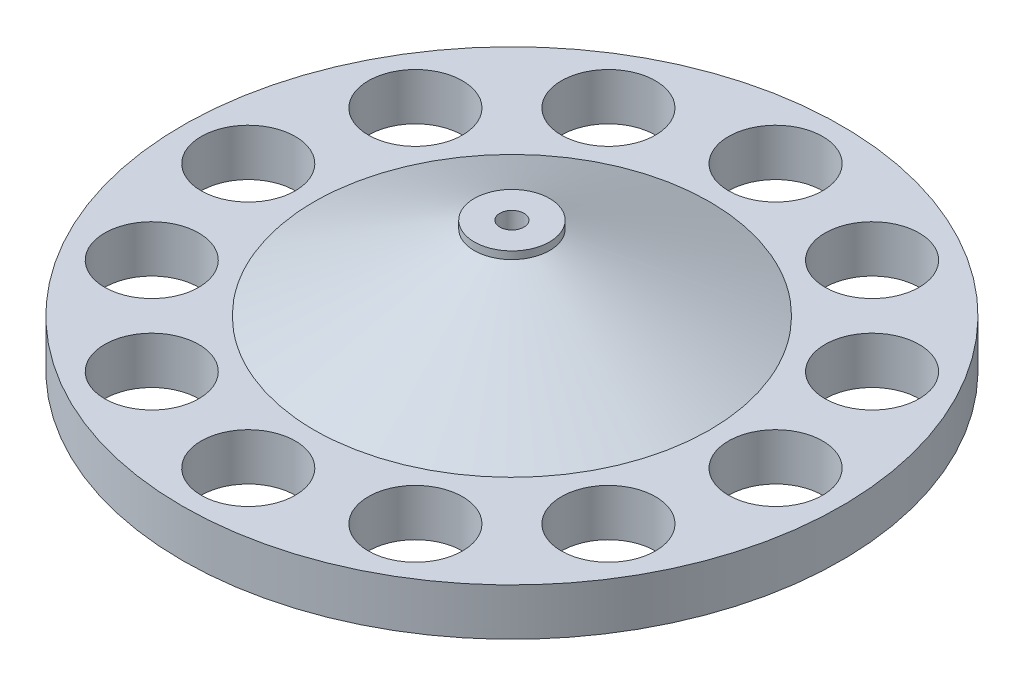
ISO-10303-21;
HEADER;
FILE_DESCRIPTION(('STEP AP214'),'2;1');
FILE_NAME('part.step','',(''),(''),'','','');
FILE_SCHEMA(('AUTOMOTIVE_DESIGN { 1 0 10303 214 1 1 1 1 }'));
ENDSEC;
DATA;
#1=APPLICATION_CONTEXT('core data for automotive mechanical design processes');
#2=APPLICATION_PROTOCOL_DEFINITION('international standard','automotive_design',2000,#1);
#3=PRODUCT_CONTEXT('',#1,'mechanical');
#4=PRODUCT('Part','Part','',(#3));
#5=PRODUCT_RELATED_PRODUCT_CATEGORY('part','',(#4));
#6=PRODUCT_DEFINITION_FORMATION('','',#4);
#7=PRODUCT_DEFINITION_CONTEXT('part definition',#1,'design');
#8=PRODUCT_DEFINITION('design','',#6,#7);
#9=PRODUCT_DEFINITION_SHAPE('','',#8);
#10=(LENGTH_UNIT() NAMED_UNIT(*) SI_UNIT(.MILLI.,.METRE.));
#11=(NAMED_UNIT(*) PLANE_ANGLE_UNIT() SI_UNIT($,.RADIAN.));
#12=(NAMED_UNIT(*) SI_UNIT($,.STERADIAN.) SOLID_ANGLE_UNIT());
#13=UNCERTAINTY_MEASURE_WITH_UNIT(LENGTH_MEASURE(1.E-05),#10,'distance_accuracy_value','');
#14=(GEOMETRIC_REPRESENTATION_CONTEXT(3) GLOBAL_UNCERTAINTY_ASSIGNED_CONTEXT((#13)) GLOBAL_UNIT_ASSIGNED_CONTEXT((#10,
#11,#12)) REPRESENTATION_CONTEXT('',''));
#15=CARTESIAN_POINT('',(0.,0.,0.));
#16=DIRECTION('',(0.,0.,1.));
#17=DIRECTION('',(1.,0.,0.));
#18=AXIS2_PLACEMENT_3D('',#15,#16,#17);
#19=CARTESIAN_POINT('',(0.,25.,0.));
#20=DIRECTION('',(0.,1.,0.));
#21=DIRECTION('',(0.,0.,1.));
#22=AXIS2_PLACEMENT_3D('',#19,#20,#21);
#23=PLANE('',#22);
#24=CARTESIAN_POINT('',(-69.999999999996,25.,-121.243556529806));
#25=DIRECTION('',(0.,1.,0.));
#26=DIRECTION('',(0.,0.,1.));
#27=AXIS2_PLACEMENT_3D('',#24,#25,#26);
#28=CIRCLE('',#27,25.0000000000116);
#29=CARTESIAN_POINT('',(-69.999999999996,25.,-96.2435565297948));
#30=VERTEX_POINT('',#29);
#31=EDGE_CURVE('E126',#30,#30,#28,.T.);
#32=ORIENTED_EDGE('',*,*,#31,.F.);
#33=EDGE_LOOP('',(#32));
#34=FACE_BOUND('',#33,.T.);
#35=CARTESIAN_POINT('',(-139.99999999997,25.,2.98342223743302E-11));
#36=DIRECTION('',(0.,1.,0.));
#37=DIRECTION('',(0.,0.,1.));
#38=AXIS2_PLACEMENT_3D('',#35,#36,#37);
#39=CIRCLE('',#38,25.0000000000399);
#40=CARTESIAN_POINT('',(-139.99999999997,25.,25.0000000000698));
#41=VERTEX_POINT('',#40);
#42=EDGE_CURVE('E138',#41,#41,#39,.T.);
#43=ORIENTED_EDGE('',*,*,#42,.F.);
#44=EDGE_LOOP('',(#43));
#45=FACE_BOUND('',#44,.T.);
#46=CARTESIAN_POINT('',(-69.9999999999443,25.,121.243556529836));
#47=DIRECTION('',(0.,1.,0.));
#48=DIRECTION('',(0.,0.,1.));
#49=AXIS2_PLACEMENT_3D('',#46,#47,#48);
#50=CIRCLE('',#49,25.0000000000597);
#51=CARTESIAN_POINT('',(-69.9999999999443,25.,146.243556529896));
#52=VERTEX_POINT('',#51);
#53=EDGE_CURVE('E150',#52,#52,#50,.T.);
#54=ORIENTED_EDGE('',*,*,#53,.F.);
#55=EDGE_LOOP('',(#54));
#56=FACE_BOUND('',#55,.T.);
#57=CARTESIAN_POINT('',(70.0000000000556,25.,121.243556529806));
#58=DIRECTION('',(0.,1.,0.));
#59=DIRECTION('',(0.,0.,1.));
#60=AXIS2_PLACEMENT_3D('',#57,#58,#59);
#61=CIRCLE('',#60,25.0000000000523);
#62=CARTESIAN_POINT('',(70.0000000000556,25.,146.243556529859));
#63=VERTEX_POINT('',#62);
#64=EDGE_CURVE('E162',#63,#63,#61,.T.);
#65=ORIENTED_EDGE('',*,*,#64,.F.);
#66=EDGE_LOOP('',(#65));
#67=FACE_BOUND('',#66,.T.);
#68=CARTESIAN_POINT('',(140.00000000003,25.,-2.98170773191421E-11));
#69=DIRECTION('',(0.,1.,0.));
#70=DIRECTION('',(0.,0.,1.));
#71=AXIS2_PLACEMENT_3D('',#68,#69,#70);
#72=CIRCLE('',#71,25.0000000000226);
#73=CARTESIAN_POINT('',(140.00000000003,25.,24.9999999999928));
#74=VERTEX_POINT('',#73);
#75=EDGE_CURVE('E174',#74,#74,#72,.T.);
#76=ORIENTED_EDGE('',*,*,#75,.F.);
#77=EDGE_LOOP('',(#76));
#78=FACE_BOUND('',#77,.T.);
#79=CARTESIAN_POINT('',(70.0000000000058,25.,-121.243556529834));
#80=DIRECTION('',(0.,1.,0.));
#81=DIRECTION('',(0.,0.,1.));
#82=AXIS2_PLACEMENT_3D('',#79,#80,#81);
#83=CIRCLE('',#82,24.9999999999994);
#84=CARTESIAN_POINT('',(70.0000000000058,25.,-96.2435565298347));
#85=VERTEX_POINT('',#84);
#86=EDGE_CURVE('E186',#85,#85,#83,.T.);
#87=ORIENTED_EDGE('',*,*,#86,.F.);
#88=EDGE_LOOP('',(#87));
#89=FACE_BOUND('',#88,.T.);
#90=CARTESIAN_POINT('',(0.,25.,0.));
#91=DIRECTION('',(0.,1.,0.));
#92=DIRECTION('',(0.,0.,1.));
#93=AXIS2_PLACEMENT_3D('',#90,#91,#92);
#94=CIRCLE('',#93,175.);
#95=CARTESIAN_POINT('',(0.,25.,175.));
#96=VERTEX_POINT('',#95);
#97=EDGE_CURVE('E56',#96,#96,#94,.T.);
#98=ORIENTED_EDGE('',*,*,#97,.T.);
#99=EDGE_LOOP('',(#98));
#100=FACE_BOUND('',#99,.T.);
#101=CARTESIAN_POINT('',(0.,25.,-140.));
#102=DIRECTION('',(0.,1.,0.));
#103=DIRECTION('',(0.,0.,1.));
#104=AXIS2_PLACEMENT_3D('',#101,#102,#103);
#105=CIRCLE('',#104,25.);
#106=CARTESIAN_POINT('',(0.,25.,-115.));
#107=VERTEX_POINT('',#106);
#108=EDGE_CURVE('E192',#107,#107,#105,.T.);
#109=ORIENTED_EDGE('',*,*,#108,.F.);
#110=EDGE_LOOP('',(#109));
#111=FACE_BOUND('',#110,.T.);
#112=CARTESIAN_POINT('',(121.243556529836,25.,-70.0000000000258));
#113=DIRECTION('',(0.,1.,0.));
#114=DIRECTION('',(0.,0.,1.));
#115=AXIS2_PLACEMENT_3D('',#112,#113,#114);
#116=CIRCLE('',#115,25.0000000000092);
#117=CARTESIAN_POINT('',(121.243556529836,25.,-45.0000000000166));
#118=VERTEX_POINT('',#117);
#119=EDGE_CURVE('E180',#118,#118,#116,.T.);
#120=ORIENTED_EDGE('',*,*,#119,.F.);
#121=EDGE_LOOP('',(#120));
#122=FACE_BOUND('',#121,.T.);
#123=CARTESIAN_POINT('',(121.243556529866,25.,69.9999999999742));
#124=DIRECTION('',(0.,1.,0.));
#125=DIRECTION('',(0.,0.,1.));
#126=AXIS2_PLACEMENT_3D('',#123,#124,#125);
#127=CIRCLE('',#126,25.0000000000383);
#128=CARTESIAN_POINT('',(121.243556529866,25.,95.0000000000124));
#129=VERTEX_POINT('',#128);
#130=EDGE_CURVE('E168',#129,#129,#127,.T.);
#131=ORIENTED_EDGE('',*,*,#130,.F.);
#132=EDGE_LOOP('',(#131));
#133=FACE_BOUND('',#132,.T.);
#134=CARTESIAN_POINT('',(5.96353792850834E-11,25.,140.));
#135=DIRECTION('',(0.,1.,0.));
#136=DIRECTION('',(0.,0.,1.));
#137=AXIS2_PLACEMENT_3D('',#134,#135,#136);
#138=CIRCLE('',#137,25.0000000000607);
#139=CARTESIAN_POINT('',(5.96353792850834E-11,25.,165.000000000061));
#140=VERTEX_POINT('',#139);
#141=EDGE_CURVE('E156',#140,#140,#138,.T.);
#142=ORIENTED_EDGE('',*,*,#141,.F.);
#143=EDGE_LOOP('',(#142));
#144=FACE_BOUND('',#143,.T.);
#145=CARTESIAN_POINT('',(-121.243556529777,25.,70.0000000000259));
#146=DIRECTION('',(0.,1.,0.));
#147=DIRECTION('',(0.,0.,1.));
#148=AXIS2_PLACEMENT_3D('',#145,#146,#147);
#149=CIRCLE('',#148,25.0000000000527);
#150=CARTESIAN_POINT('',(-121.243556529777,25.,95.0000000000786));
#151=VERTEX_POINT('',#150);
#152=EDGE_CURVE('E144',#151,#151,#149,.T.);
#153=ORIENTED_EDGE('',*,*,#152,.F.);
#154=EDGE_LOOP('',(#153));
#155=FACE_BOUND('',#154,.T.);
#156=CARTESIAN_POINT('',(-121.243556529807,25.,-69.9999999999741));
#157=DIRECTION('',(0.,1.,0.));
#158=DIRECTION('',(0.,0.,1.));
#159=AXIS2_PLACEMENT_3D('',#156,#157,#158);
#160=CIRCLE('',#159,25.000000000025);
#161=CARTESIAN_POINT('',(-121.243556529807,25.,-44.999999999949));
#162=VERTEX_POINT('',#161);
#163=EDGE_CURVE('E132',#162,#162,#160,.T.);
#164=ORIENTED_EDGE('',*,*,#163,.F.);
#165=EDGE_LOOP('',(#164));
#166=FACE_BOUND('',#165,.T.);
#167=CARTESIAN_POINT('',(0.,25.,0.));
#168=DIRECTION('',(0.,1.,0.));
#169=DIRECTION('',(0.,0.,1.));
#170=AXIS2_PLACEMENT_3D('',#167,#168,#169);
#171=CIRCLE('',#170,105.);
#172=CARTESIAN_POINT('',(74.5720447437482,25.,-73.9189430574897));
#173=VERTEX_POINT('',#172);
#174=EDGE_CURVE('E112',#173,#173,#171,.T.);
#175=ORIENTED_EDGE('',*,*,#174,.F.);
#176=EDGE_LOOP('',(#175));
#177=FACE_BOUND('',#176,.T.);
#178=ADVANCED_FACE('F42',(#34,#45,#56,#67,#78,#89,#100,#111,#122,#133,#144,#155,#166,#177),#23,.T.);
#179=CARTESIAN_POINT('',(0.,0.,0.));
#180=DIRECTION('',(0.,1.,0.));
#181=DIRECTION('',(0.,0.,1.));
#182=AXIS2_PLACEMENT_3D('',#179,#180,#181);
#183=PLANE('',#182);
#184=CARTESIAN_POINT('',(0.,0.,0.));
#185=DIRECTION('',(0.,1.,0.));
#186=DIRECTION('',(0.,0.,1.));
#187=AXIS2_PLACEMENT_3D('',#184,#185,#186);
#188=CIRCLE('',#187,111.);
#189=CARTESIAN_POINT('',(0.,0.,111.));
#190=VERTEX_POINT('',#189);
#191=EDGE_CURVE('E11',#190,#190,#188,.T.);
#192=ORIENTED_EDGE('',*,*,#191,.T.);
#193=EDGE_LOOP('',(#192));
#194=FACE_BOUND('',#193,.T.);
#195=CARTESIAN_POINT('',(0.,0.,0.));
#196=DIRECTION('',(0.,1.,0.));
#197=DIRECTION('',(0.,0.,1.));
#198=AXIS2_PLACEMENT_3D('',#195,#196,#197);
#199=CIRCLE('',#198,175.);
#200=CARTESIAN_POINT('',(0.,0.,175.));
#201=VERTEX_POINT('',#200);
#202=EDGE_CURVE('E195',#201,#201,#199,.T.);
#203=ORIENTED_EDGE('',*,*,#202,.F.);
#204=EDGE_LOOP('',(#203));
#205=FACE_BOUND('',#204,.T.);
#206=CARTESIAN_POINT('',(0.,0.,-140.));
#207=DIRECTION('',(0.,1.,0.));
#208=DIRECTION('',(0.,0.,1.));
#209=AXIS2_PLACEMENT_3D('',#206,#207,#208);
#210=CIRCLE('',#209,25.);
#211=CARTESIAN_POINT('',(0.,0.,-115.));
#212=VERTEX_POINT('',#211);
#213=EDGE_CURVE('E189',#212,#212,#210,.T.);
#214=ORIENTED_EDGE('',*,*,#213,.T.);
#215=EDGE_LOOP('',(#214));
#216=FACE_BOUND('',#215,.T.);
#217=CARTESIAN_POINT('',(70.0000000000058,0.,-121.243556529834));
#218=DIRECTION('',(0.,1.,0.));
#219=DIRECTION('',(0.,0.,1.));
#220=AXIS2_PLACEMENT_3D('',#217,#218,#219);
#221=CIRCLE('',#220,24.9999999999994);
#222=CARTESIAN_POINT('',(70.0000000000058,0.,-96.2435565298347));
#223=VERTEX_POINT('',#222);
#224=EDGE_CURVE('E183',#223,#223,#221,.T.);
#225=ORIENTED_EDGE('',*,*,#224,.T.);
#226=EDGE_LOOP('',(#225));
#227=FACE_BOUND('',#226,.T.);
#228=CARTESIAN_POINT('',(121.243556529836,0.,-70.0000000000258));
#229=DIRECTION('',(0.,1.,0.));
#230=DIRECTION('',(0.,0.,1.));
#231=AXIS2_PLACEMENT_3D('',#228,#229,#230);
#232=CIRCLE('',#231,25.0000000000092);
#233=CARTESIAN_POINT('',(121.243556529836,0.,-45.0000000000166));
#234=VERTEX_POINT('',#233);
#235=EDGE_CURVE('E177',#234,#234,#232,.T.);
#236=ORIENTED_EDGE('',*,*,#235,.T.);
#237=EDGE_LOOP('',(#236));
#238=FACE_BOUND('',#237,.T.);
#239=CARTESIAN_POINT('',(140.00000000003,0.,-2.98170773191421E-11));
#240=DIRECTION('',(0.,1.,0.));
#241=DIRECTION('',(0.,0.,1.));
#242=AXIS2_PLACEMENT_3D('',#239,#240,#241);
#243=CIRCLE('',#242,25.0000000000226);
#244=CARTESIAN_POINT('',(140.00000000003,0.,24.9999999999928));
#245=VERTEX_POINT('',#244);
#246=EDGE_CURVE('E171',#245,#245,#243,.T.);
#247=ORIENTED_EDGE('',*,*,#246,.T.);
#248=EDGE_LOOP('',(#247));
#249=FACE_BOUND('',#248,.T.);
#250=CARTESIAN_POINT('',(121.243556529866,0.,69.9999999999742));
#251=DIRECTION('',(0.,1.,0.));
#252=DIRECTION('',(0.,0.,1.));
#253=AXIS2_PLACEMENT_3D('',#250,#251,#252);
#254=CIRCLE('',#253,25.0000000000383);
#255=CARTESIAN_POINT('',(121.243556529866,0.,95.0000000000124));
#256=VERTEX_POINT('',#255);
#257=EDGE_CURVE('E165',#256,#256,#254,.T.);
#258=ORIENTED_EDGE('',*,*,#257,.T.);
#259=EDGE_LOOP('',(#258));
#260=FACE_BOUND('',#259,.T.);
#261=CARTESIAN_POINT('',(70.0000000000556,0.,121.243556529806));
#262=DIRECTION('',(0.,1.,0.));
#263=DIRECTION('',(0.,0.,1.));
#264=AXIS2_PLACEMENT_3D('',#261,#262,#263);
#265=CIRCLE('',#264,25.0000000000523);
#266=CARTESIAN_POINT('',(70.0000000000556,0.,146.243556529859));
#267=VERTEX_POINT('',#266);
#268=EDGE_CURVE('E159',#267,#267,#265,.T.);
#269=ORIENTED_EDGE('',*,*,#268,.T.);
#270=EDGE_LOOP('',(#269));
#271=FACE_BOUND('',#270,.T.);
#272=CARTESIAN_POINT('',(5.96353792850834E-11,0.,140.));
#273=DIRECTION('',(0.,1.,0.));
#274=DIRECTION('',(0.,0.,1.));
#275=AXIS2_PLACEMENT_3D('',#272,#273,#274);
#276=CIRCLE('',#275,25.0000000000607);
#277=CARTESIAN_POINT('',(5.96353792850834E-11,0.,165.000000000061));
#278=VERTEX_POINT('',#277);
#279=EDGE_CURVE('E153',#278,#278,#276,.T.);
#280=ORIENTED_EDGE('',*,*,#279,.T.);
#281=EDGE_LOOP('',(#280));
#282=FACE_BOUND('',#281,.T.);
#283=CARTESIAN_POINT('',(-69.9999999999443,0.,121.243556529836));
#284=DIRECTION('',(0.,1.,0.));
#285=DIRECTION('',(0.,0.,1.));
#286=AXIS2_PLACEMENT_3D('',#283,#284,#285);
#287=CIRCLE('',#286,25.0000000000597);
#288=CARTESIAN_POINT('',(-69.9999999999443,0.,146.243556529896));
#289=VERTEX_POINT('',#288);
#290=EDGE_CURVE('E147',#289,#289,#287,.T.);
#291=ORIENTED_EDGE('',*,*,#290,.T.);
#292=EDGE_LOOP('',(#291));
#293=FACE_BOUND('',#292,.T.);
#294=CARTESIAN_POINT('',(-121.243556529777,0.,70.0000000000259));
#295=DIRECTION('',(0.,1.,0.));
#296=DIRECTION('',(0.,0.,1.));
#297=AXIS2_PLACEMENT_3D('',#294,#295,#296);
#298=CIRCLE('',#297,25.0000000000527);
#299=CARTESIAN_POINT('',(-121.243556529777,0.,95.0000000000786));
#300=VERTEX_POINT('',#299);
#301=EDGE_CURVE('E141',#300,#300,#298,.T.);
#302=ORIENTED_EDGE('',*,*,#301,.T.);
#303=EDGE_LOOP('',(#302));
#304=FACE_BOUND('',#303,.T.);
#305=CARTESIAN_POINT('',(-139.99999999997,0.,2.98342223743302E-11));
#306=DIRECTION('',(0.,1.,0.));
#307=DIRECTION('',(0.,0.,1.));
#308=AXIS2_PLACEMENT_3D('',#305,#306,#307);
#309=CIRCLE('',#308,25.0000000000399);
#310=CARTESIAN_POINT('',(-139.99999999997,0.,25.0000000000698));
#311=VERTEX_POINT('',#310);
#312=EDGE_CURVE('E135',#311,#311,#309,.T.);
#313=ORIENTED_EDGE('',*,*,#312,.T.);
#314=EDGE_LOOP('',(#313));
#315=FACE_BOUND('',#314,.T.);
#316=CARTESIAN_POINT('',(-121.243556529807,0.,-69.9999999999741));
#317=DIRECTION('',(0.,1.,0.));
#318=DIRECTION('',(0.,0.,1.));
#319=AXIS2_PLACEMENT_3D('',#316,#317,#318);
#320=CIRCLE('',#319,25.000000000025);
#321=CARTESIAN_POINT('',(-121.243556529807,0.,-44.999999999949));
#322=VERTEX_POINT('',#321);
#323=EDGE_CURVE('E129',#322,#322,#320,.T.);
#324=ORIENTED_EDGE('',*,*,#323,.T.);
#325=EDGE_LOOP('',(#324));
#326=FACE_BOUND('',#325,.T.);
#327=CARTESIAN_POINT('',(-69.999999999996,0.,-121.243556529806));
#328=DIRECTION('',(0.,1.,0.));
#329=DIRECTION('',(0.,0.,1.));
#330=AXIS2_PLACEMENT_3D('',#327,#328,#329);
#331=CIRCLE('',#330,25.0000000000116);
#332=CARTESIAN_POINT('',(-69.999999999996,0.,-96.2435565297948));
#333=VERTEX_POINT('',#332);
#334=EDGE_CURVE('E125',#333,#333,#331,.T.);
#335=ORIENTED_EDGE('',*,*,#334,.T.);
#336=EDGE_LOOP('',(#335));
#337=FACE_BOUND('',#336,.T.);
#338=ADVANCED_FACE('F228',(#194,#205,#216,#227,#238,#249,#260,#271,#282,#293,#304,#315,#326,
#337),#183,.F.);
#339=CARTESIAN_POINT('',(0.,25.,0.));
#340=DIRECTION('',(0.,-1.,0.));
#341=DIRECTION('',(0.,0.,-1.));
#342=AXIS2_PLACEMENT_3D('',#339,#340,#341);
#343=CYLINDRICAL_SURFACE('',#342,175.);
#344=ORIENTED_EDGE('',*,*,#97,.F.);
#345=EDGE_LOOP('',(#344));
#346=FACE_BOUND('',#345,.T.);
#347=ORIENTED_EDGE('',*,*,#202,.T.);
#348=EDGE_LOOP('',(#347));
#349=FACE_BOUND('',#348,.T.);
#350=ADVANCED_FACE('F234',(#346,#349),#343,.T.);
#351=CARTESIAN_POINT('',(0.,25.,-140.));
#352=DIRECTION('',(0.,-1.,0.));
#353=DIRECTION('',(0.,0.,-1.));
#354=AXIS2_PLACEMENT_3D('',#351,#352,#353);
#355=CYLINDRICAL_SURFACE('',#354,25.);
#356=ORIENTED_EDGE('',*,*,#108,.T.);
#357=EDGE_LOOP('',(#356));
#358=FACE_BOUND('',#357,.T.);
#359=ORIENTED_EDGE('',*,*,#213,.F.);
#360=EDGE_LOOP('',(#359));
#361=FACE_BOUND('',#360,.T.);
#362=ADVANCED_FACE('F239',(#358,#361),#355,.F.);
#363=CARTESIAN_POINT('',(70.0000000000058,25.,-121.243556529834));
#364=DIRECTION('',(0.,-1.,0.));
#365=DIRECTION('',(0.,0.,-1.));
#366=AXIS2_PLACEMENT_3D('',#363,#364,#365);
#367=CYLINDRICAL_SURFACE('',#366,24.9999999999994);
#368=ORIENTED_EDGE('',*,*,#86,.T.);
#369=EDGE_LOOP('',(#368));
#370=FACE_BOUND('',#369,.T.);
#371=ORIENTED_EDGE('',*,*,#224,.F.);
#372=EDGE_LOOP('',(#371));
#373=FACE_BOUND('',#372,.T.);
#374=ADVANCED_FACE('F246',(#370,#373),#367,.F.);
#375=CARTESIAN_POINT('',(121.243556529836,25.,-70.0000000000258));
#376=DIRECTION('',(0.,-1.,0.));
#377=DIRECTION('',(0.,0.,-1.));
#378=AXIS2_PLACEMENT_3D('',#375,#376,#377);
#379=CYLINDRICAL_SURFACE('',#378,25.0000000000092);
#380=ORIENTED_EDGE('',*,*,#119,.T.);
#381=EDGE_LOOP('',(#380));
#382=FACE_BOUND('',#381,.T.);
#383=ORIENTED_EDGE('',*,*,#235,.F.);
#384=EDGE_LOOP('',(#383));
#385=FACE_BOUND('',#384,.T.);
#386=ADVANCED_FACE('F313',(#382,#385),#379,.F.);
#387=CARTESIAN_POINT('',(140.00000000003,25.,-2.98170773191421E-11));
#388=DIRECTION('',(0.,-1.,0.));
#389=DIRECTION('',(0.,0.,-1.));
#390=AXIS2_PLACEMENT_3D('',#387,#388,#389);
#391=CYLINDRICAL_SURFACE('',#390,25.0000000000226);
#392=ORIENTED_EDGE('',*,*,#75,.T.);
#393=EDGE_LOOP('',(#392));
#394=FACE_BOUND('',#393,.T.);
#395=ORIENTED_EDGE('',*,*,#246,.F.);
#396=EDGE_LOOP('',(#395));
#397=FACE_BOUND('',#396,.T.);
#398=ADVANCED_FACE('F309',(#394,#397),#391,.F.);
#399=CARTESIAN_POINT('',(121.243556529866,25.,69.9999999999742));
#400=DIRECTION('',(0.,-1.,0.));
#401=DIRECTION('',(0.,0.,-1.));
#402=AXIS2_PLACEMENT_3D('',#399,#400,#401);
#403=CYLINDRICAL_SURFACE('',#402,25.0000000000383);
#404=ORIENTED_EDGE('',*,*,#130,.T.);
#405=EDGE_LOOP('',(#404));
#406=FACE_BOUND('',#405,.T.);
#407=ORIENTED_EDGE('',*,*,#257,.F.);
#408=EDGE_LOOP('',(#407));
#409=FACE_BOUND('',#408,.T.);
#410=ADVANCED_FACE('F305',(#406,#409),#403,.F.);
#411=CARTESIAN_POINT('',(70.0000000000556,25.,121.243556529806));
#412=DIRECTION('',(0.,-1.,0.));
#413=DIRECTION('',(0.,0.,-1.));
#414=AXIS2_PLACEMENT_3D('',#411,#412,#413);
#415=CYLINDRICAL_SURFACE('',#414,25.0000000000523);
#416=ORIENTED_EDGE('',*,*,#64,.T.);
#417=EDGE_LOOP('',(#416));
#418=FACE_BOUND('',#417,.T.);
#419=ORIENTED_EDGE('',*,*,#268,.F.);
#420=EDGE_LOOP('',(#419));
#421=FACE_BOUND('',#420,.T.);
#422=ADVANCED_FACE('F301',(#418,#421),#415,.F.);
#423=CARTESIAN_POINT('',(5.96353792850834E-11,25.,140.));
#424=DIRECTION('',(0.,-1.,0.));
#425=DIRECTION('',(0.,0.,-1.));
#426=AXIS2_PLACEMENT_3D('',#423,#424,#425);
#427=CYLINDRICAL_SURFACE('',#426,25.0000000000607);
#428=ORIENTED_EDGE('',*,*,#141,.T.);
#429=EDGE_LOOP('',(#428));
#430=FACE_BOUND('',#429,.T.);
#431=ORIENTED_EDGE('',*,*,#279,.F.);
#432=EDGE_LOOP('',(#431));
#433=FACE_BOUND('',#432,.T.);
#434=ADVANCED_FACE('F297',(#430,#433),#427,.F.);
#435=CARTESIAN_POINT('',(-69.9999999999443,25.,121.243556529836));
#436=DIRECTION('',(0.,-1.,0.));
#437=DIRECTION('',(0.,0.,-1.));
#438=AXIS2_PLACEMENT_3D('',#435,#436,#437);
#439=CYLINDRICAL_SURFACE('',#438,25.0000000000597);
#440=ORIENTED_EDGE('',*,*,#53,.T.);
#441=EDGE_LOOP('',(#440));
#442=FACE_BOUND('',#441,.T.);
#443=ORIENTED_EDGE('',*,*,#290,.F.);
#444=EDGE_LOOP('',(#443));
#445=FACE_BOUND('',#444,.T.);
#446=ADVANCED_FACE('F293',(#442,#445),#439,.F.);
#447=CARTESIAN_POINT('',(-121.243556529777,25.,70.0000000000259));
#448=DIRECTION('',(0.,-1.,0.));
#449=DIRECTION('',(0.,0.,-1.));
#450=AXIS2_PLACEMENT_3D('',#447,#448,#449);
#451=CYLINDRICAL_SURFACE('',#450,25.0000000000527);
#452=ORIENTED_EDGE('',*,*,#152,.T.);
#453=EDGE_LOOP('',(#452));
#454=FACE_BOUND('',#453,.T.);
#455=ORIENTED_EDGE('',*,*,#301,.F.);
#456=EDGE_LOOP('',(#455));
#457=FACE_BOUND('',#456,.T.);
#458=ADVANCED_FACE('F289',(#454,#457),#451,.F.);
#459=CARTESIAN_POINT('',(-139.99999999997,25.,2.98342223743302E-11));
#460=DIRECTION('',(0.,-1.,0.));
#461=DIRECTION('',(0.,0.,-1.));
#462=AXIS2_PLACEMENT_3D('',#459,#460,#461);
#463=CYLINDRICAL_SURFACE('',#462,25.0000000000399);
#464=ORIENTED_EDGE('',*,*,#42,.T.);
#465=EDGE_LOOP('',(#464));
#466=FACE_BOUND('',#465,.T.);
#467=ORIENTED_EDGE('',*,*,#312,.F.);
#468=EDGE_LOOP('',(#467));
#469=FACE_BOUND('',#468,.T.);
#470=ADVANCED_FACE('F283',(#466,#469),#463,.F.);
#471=CARTESIAN_POINT('',(-121.243556529807,25.,-69.9999999999741));
#472=DIRECTION('',(0.,-1.,0.));
#473=DIRECTION('',(0.,0.,-1.));
#474=AXIS2_PLACEMENT_3D('',#471,#472,#473);
#475=CYLINDRICAL_SURFACE('',#474,25.000000000025);
#476=ORIENTED_EDGE('',*,*,#163,.T.);
#477=EDGE_LOOP('',(#476));
#478=FACE_BOUND('',#477,.T.);
#479=ORIENTED_EDGE('',*,*,#323,.F.);
#480=EDGE_LOOP('',(#479));
#481=FACE_BOUND('',#480,.T.);
#482=ADVANCED_FACE('F278',(#478,#481),#475,.F.);
#483=CARTESIAN_POINT('',(-69.999999999996,25.,-121.243556529806));
#484=DIRECTION('',(0.,-1.,0.));
#485=DIRECTION('',(0.,0.,-1.));
#486=AXIS2_PLACEMENT_3D('',#483,#484,#485);
#487=CYLINDRICAL_SURFACE('',#486,25.0000000000116);
#488=ORIENTED_EDGE('',*,*,#31,.T.);
#489=EDGE_LOOP('',(#488));
#490=FACE_BOUND('',#489,.T.);
#491=ORIENTED_EDGE('',*,*,#334,.F.);
#492=EDGE_LOOP('',(#491));
#493=FACE_BOUND('',#492,.T.);
#494=ADVANCED_FACE('F98',(#490,#493),#487,.F.);
#495=CARTESIAN_POINT('',(74.5720447437482,25.,-73.9189430574897));
#496=CARTESIAN_POINT('',(17.1375903100791,65.,-10.3103345418023));
#497=CARTESIAN_POINT('',(-73.2658413712311,25.,-223.063032544986));
#498=CARTESIAN_POINT('',(-3.48307877352543,65.,-44.5855151619606));
#499=CARTESIAN_POINT('',(-222.409930858727,25.,-75.2251464300068));
#500=CARTESIAN_POINT('',(-37.7582593936837,65.,-23.964846078356));
#501=CARTESIAN_POINT('',(-74.5720447437483,25.,73.9189430574897));
#502=CARTESIAN_POINT('',(-17.1375903100791,65.,10.3103345418023));
#503=CARTESIAN_POINT('',(73.265841371231,25.,223.063032544986));
#504=CARTESIAN_POINT('',(3.48307877352543,65.,44.5855151619606));
#505=CARTESIAN_POINT('',(222.409930858728,25.,75.2251464300069));
#506=CARTESIAN_POINT('',(37.7582593936837,65.,23.964846078356));
#507=CARTESIAN_POINT('',(74.5720447437482,25.,-73.9189430574897));
#508=CARTESIAN_POINT('',(17.1375903100791,65.,-10.3103345418023));
#509=(BOUNDED_SURFACE() B_SPLINE_SURFACE(3,1,((#495,#496),(#497,#498),(#499,#500),(#501,#502),
(#503,#504),(#505,#506),(#507,#508)),.UNSPECIFIED.,.T.,.F.,.F.) B_SPLINE_SURFACE_WITH_KNOTS((4,
3,4),(2,2),(0.,0.5,1.),(0.,1.),
.UNSPECIFIED.) GEOMETRIC_REPRESENTATION_ITEM() RATIONAL_B_SPLINE_SURFACE(((1.,1.),
(0.333333333333334,0.333333333333333),(0.333333333333334,0.333333333333333),(1.,1.),
(0.333333333333333,0.333333333333333),(0.333333333333333,0.333333333333333),(1.,1.))) REPRESENTATION_ITEM('') SURFACE());
#510=CARTESIAN_POINT('',(0.,65.,0.));
#511=DIRECTION('',(0.,1.,0.));
#512=DIRECTION('',(0.,0.,1.));
#513=AXIS2_PLACEMENT_3D('',#510,#511,#512);
#514=CIRCLE('',#513,20.);
#515=CARTESIAN_POINT('',(17.1375903100791,65.,-10.3103345418023));
#516=VERTEX_POINT('',#515);
#517=EDGE_CURVE('E46',#516,#516,#514,.T.);
#518=CARTESIAN_POINT('',(74.5720447437482,25.,-73.9189430574897));
#519=CARTESIAN_POINT('',(73.9737691767308,25.4166666666667,-73.2563533854513));
#520=CARTESIAN_POINT('',(73.3754936097135,25.8333333333333,-72.5937637134129));
#521=CARTESIAN_POINT('',(72.1789424756787,26.6666666666667,-71.2685843693361));
#522=CARTESIAN_POINT('',(71.5806669086613,27.0833333333333,-70.6059946972977));
#523=CARTESIAN_POINT('',(70.3841157746265,27.9166666666667,-69.2808153532208));
#524=CARTESIAN_POINT('',(69.7858402076091,28.3333333333333,-68.6182256811825));
#525=CARTESIAN_POINT('',(68.5892890735744,29.1666666666667,-67.2930463371056));
#526=CARTESIAN_POINT('',(67.991013506557,29.5833333333333,-66.6304566650672));
#527=CARTESIAN_POINT('',(66.7944623725222,30.4166666666667,-65.3052773209904));
#528=CARTESIAN_POINT('',(66.1961868055048,30.8333333333333,-64.642687648952));
#529=CARTESIAN_POINT('',(64.9996356714701,31.6666666666667,-63.3175083048752));
#530=CARTESIAN_POINT('',(64.4013601044527,32.0833333333333,-62.6549186328368));
#531=CARTESIAN_POINT('',(63.2048089704179,32.9166666666667,-61.3297392887599));
#532=CARTESIAN_POINT('',(62.6065334034005,33.3333333333333,-60.6671496167215));
#533=CARTESIAN_POINT('',(61.4099822693657,34.1666666666667,-59.3419702726447));
#534=CARTESIAN_POINT('',(60.8117067023483,34.5833333333333,-58.6793806006063));
#535=CARTESIAN_POINT('',(59.6151555683136,35.4166666666667,-57.3542012565295));
#536=CARTESIAN_POINT('',(59.0168800012962,35.8333333333333,-56.691611584491));
#537=CARTESIAN_POINT('',(57.8203288672614,36.6666666666667,-55.3664322404142));
#538=CARTESIAN_POINT('',(57.222053300244,37.0833333333333,-54.7038425683758));
#539=CARTESIAN_POINT('',(56.0255021662093,37.9166666666667,-53.378663224299));
#540=CARTESIAN_POINT('',(55.4272265991919,38.3333333333333,-52.7160735522606));
#541=CARTESIAN_POINT('',(54.2306754651571,39.1666666666667,-51.3908942081838));
#542=CARTESIAN_POINT('',(53.6323998981397,39.5833333333333,-50.7283045361454));
#543=CARTESIAN_POINT('',(52.4358487641049,40.4166666666667,-49.4031251920685));
#544=CARTESIAN_POINT('',(51.8375731970876,40.8333333333333,-48.7405355200301));
#545=CARTESIAN_POINT('',(50.6410220630528,41.6666666666667,-47.4153561759533));
#546=CARTESIAN_POINT('',(50.0427464960354,42.0833333333333,-46.7527665039149));
#547=CARTESIAN_POINT('',(48.8461953620006,42.9166666666667,-45.4275871598381));
#548=CARTESIAN_POINT('',(48.2479197949832,43.3333333333333,-44.7649974877997));
#549=CARTESIAN_POINT('',(47.0513686609485,44.1666666666667,-43.4398181437228));
#550=CARTESIAN_POINT('',(46.4530930939311,44.5833333333333,-42.7772284716844));
#551=CARTESIAN_POINT('',(45.2565419598963,45.4166666666667,-41.4520491276076));
#552=CARTESIAN_POINT('',(44.6582663928789,45.8333333333333,-40.7894594555692));
#553=CARTESIAN_POINT('',(43.4617152588442,46.6666666666667,-39.4642801114924));
#554=CARTESIAN_POINT('',(42.8634396918268,47.0833333333333,-38.801690439454));
#555=CARTESIAN_POINT('',(41.666888557792,47.9166666666667,-37.4765110953771));
#556=CARTESIAN_POINT('',(41.0686129907746,48.3333333333333,-36.8139214233387));
#557=CARTESIAN_POINT('',(39.8720618567398,49.1666666666667,-35.4887420792619));
#558=CARTESIAN_POINT('',(39.2737862897224,49.5833333333333,-34.8261524072235));
#559=CARTESIAN_POINT('',(38.0772351556877,50.4166666666667,-33.5009730631467));
#560=CARTESIAN_POINT('',(37.4789595886703,50.8333333333333,-32.8383833911083));
#561=CARTESIAN_POINT('',(36.2824084546355,51.6666666666667,-31.5132040470314));
#562=CARTESIAN_POINT('',(35.6841328876181,52.0833333333333,-30.850614374993));
#563=CARTESIAN_POINT('',(34.4875817535833,52.9166666666667,-29.5254350309162));
#564=CARTESIAN_POINT('',(33.889306186566,53.3333333333333,-28.8628453588778));
#565=CARTESIAN_POINT('',(32.6927550525312,54.1666666666667,-27.537666014801));
#566=CARTESIAN_POINT('',(32.0944794855138,54.5833333333333,-26.8750763427626));
#567=CARTESIAN_POINT('',(30.897928351479,55.4166666666667,-25.5498969986857));
#568=CARTESIAN_POINT('',(30.2996527844616,55.8333333333333,-24.8873073266473));
#569=CARTESIAN_POINT('',(29.1031016504269,56.6666666666667,-23.5621279825705));
#570=CARTESIAN_POINT('',(28.5048260834095,57.0833333333333,-22.8995383105321));
#571=CARTESIAN_POINT('',(27.3082749493747,57.9166666666667,-21.5743589664553));
#572=CARTESIAN_POINT('',(26.7099993823573,58.3333333333333,-20.9117692944169));
#573=CARTESIAN_POINT('',(25.5134482483226,59.1666666666667,-19.58658995034));
#574=CARTESIAN_POINT('',(24.9151726813052,59.5833333333333,-18.9240002783016));
#575=CARTESIAN_POINT('',(23.7186215472704,60.4166666666667,-17.5988209342248));
#576=CARTESIAN_POINT('',(23.120345980253,60.8333333333333,-16.9362312621864));
#577=CARTESIAN_POINT('',(21.9237948462182,61.6666666666667,-15.6110519181096));
#578=CARTESIAN_POINT('',(21.3255192792009,62.0833333333333,-14.9484622460712));
#579=CARTESIAN_POINT('',(20.1289681451661,62.9166666666667,-13.6232829019943));
#580=CARTESIAN_POINT('',(19.5306925781487,63.3333333333333,-12.9606932299559));
#581=CARTESIAN_POINT('',(18.3341414441139,64.1666666666667,-11.6355138858791));
#582=CARTESIAN_POINT('',(17.7358658770965,64.5833333333333,-10.9729242138407));
#583=CARTESIAN_POINT('',(17.1375903100791,65.,-10.3103345418023));
#584=B_SPLINE_CURVE_WITH_KNOTS('',3,(#518,#519,#520,#521,#522,#523,#524,#525,#526,#527,#528,
#529,#530,#531,#532,#533,#534,#535,#536,#537,#538,#539,#540,#541,#542,#543,#544,#545,#546,#547,
#548,#549,#550,#551,#552,#553,#554,#555,#556,#557,#558,#559,#560,#561,#562,#563,#564,#565,#566,
#567,#568,#569,#570,#571,#572,#573,#574,#575,#576,#577,#578,#579,#580,#581,#582,#583),
.UNSPECIFIED.,.F.,.F.,(4,2,2,2,2,2,2,2,2,2,2,2,2,2,2,2,2,2,2,2,2,2,2,2,2,2,2,2,2,2,2,2,4),(0.,
2.9555250884128,5.9110501768256,8.86657526523841,11.8221003536512,14.777625442064,
17.7331505304768,20.6886756188896,23.6442007073024,26.5997257957152,29.555250884128,
32.5107759725408,35.4663010609536,38.4218261493664,41.3773512377792,44.332876326192,
47.2884014146048,50.2439265030176,53.1994515914304,56.1549766798432,59.110501768256,
62.0660268566688,65.0215519450816,67.9770770334944,70.9326021219072,73.88812721032,
76.8436522987328,79.7991773871456,82.7547024755584,85.7102275639712,88.665752652384,
91.6212777407968,94.5768028292096),.UNSPECIFIED.);
#585=EDGE_CURVE('BSEAM83',#173,#516,#584,.T.);
#586=ORIENTED_EDGE('',*,*,#174,.T.);
#587=ORIENTED_EDGE('',*,*,#517,.F.);
#588=ORIENTED_EDGE('',*,*,#585,.T.);
#589=ORIENTED_EDGE('',*,*,#585,.F.);
#590=EDGE_LOOP('',(#586,#588,#587,#589));
#591=FACE_BOUND('',#590,.T.);
#592=ADVANCED_FACE('F83',(#591),#509,.T.);
#593=CARTESIAN_POINT('',(0.,18.,0.));
#594=DIRECTION('',(0.,-1.,0.));
#595=DIRECTION('',(0.,0.,-1.));
#596=AXIS2_PLACEMENT_3D('',#593,#594,#595);
#597=PLANE('',#596);
#598=CARTESIAN_POINT('',(0.,18.,0.));
#599=DIRECTION('',(0.,-1.,0.));
#600=DIRECTION('',(0.,0.,-1.));
#601=AXIS2_PLACEMENT_3D('',#598,#599,#600);
#602=CIRCLE('',#601,103.);
#603=CARTESIAN_POINT('',(0.,18.,-103.));
#604=VERTEX_POINT('',#603);
#605=EDGE_CURVE('E202',#604,#604,#602,.T.);
#606=ORIENTED_EDGE('',*,*,#605,.T.);
#607=EDGE_LOOP('',(#606));
#608=FACE_BOUND('',#607,.T.);
#609=CARTESIAN_POINT('',(0.,18.,0.));
#610=DIRECTION('',(0.,-1.,0.));
#611=DIRECTION('',(0.,0.,-1.));
#612=AXIS2_PLACEMENT_3D('',#609,#610,#611);
#613=CIRCLE('',#612,10.);
#614=CARTESIAN_POINT('',(0.,18.,-10.));
#615=VERTEX_POINT('',#614);
#616=EDGE_CURVE('E119',#615,#615,#613,.F.);
#617=ORIENTED_EDGE('',*,*,#616,.T.);
#618=EDGE_LOOP('',(#617));
#619=FACE_BOUND('',#618,.T.);
#620=ADVANCED_FACE('F79',(#608,#619),#597,.T.);
#621=CARTESIAN_POINT('',(0.,18.,0.));
#622=DIRECTION('',(0.,-1.,0.));
#623=DIRECTION('',(0.,0.,-1.));
#624=AXIS2_PLACEMENT_3D('',#621,#622,#623);
#625=CYLINDRICAL_SURFACE('',#624,103.);
#626=CARTESIAN_POINT('',(0.,8.,0.));
#627=DIRECTION('',(0.,1.,0.));
#628=DIRECTION('',(0.,0.,1.));
#629=AXIS2_PLACEMENT_3D('',#626,#627,#628);
#630=CIRCLE('',#629,103.);
#631=CARTESIAN_POINT('',(0.,8.,103.));
#632=VERTEX_POINT('',#631);
#633=EDGE_CURVE('E51',#632,#632,#630,.F.);
#634=ORIENTED_EDGE('',*,*,#633,.T.);
#635=EDGE_LOOP('',(#634));
#636=FACE_BOUND('',#635,.T.);
#637=ORIENTED_EDGE('',*,*,#605,.F.);
#638=EDGE_LOOP('',(#637));
#639=FACE_BOUND('',#638,.T.);
#640=ADVANCED_FACE('F82',(#636,#639),#625,.F.);
#641=CARTESIAN_POINT('',(0.,25.,0.));
#642=DIRECTION('',(0.,1.,0.));
#643=DIRECTION('',(0.,0.,1.));
#644=AXIS2_PLACEMENT_3D('',#641,#642,#643);
#645=PLANE('',#644);
#646=CARTESIAN_POINT('',(0.,25.,0.));
#647=DIRECTION('',(0.,1.,0.));
#648=DIRECTION('',(0.,0.,1.));
#649=AXIS2_PLACEMENT_3D('',#646,#647,#648);
#650=CIRCLE('',#649,6.4);
#651=CARTESIAN_POINT('',(0.,25.,6.4));
#652=VERTEX_POINT('',#651);
#653=EDGE_CURVE('E209',#652,#652,#650,.T.);
#654=ORIENTED_EDGE('',*,*,#653,.T.);
#655=EDGE_LOOP('',(#654));
#656=FACE_BOUND('',#655,.T.);
#657=CARTESIAN_POINT('',(0.,25.,0.));
#658=DIRECTION('',(0.,-1.,0.));
#659=DIRECTION('',(0.,0.,-1.));
#660=AXIS2_PLACEMENT_3D('',#657,#658,#659);
#661=CIRCLE('',#660,10.);
#662=CARTESIAN_POINT('',(0.,25.,-10.));
#663=VERTEX_POINT('',#662);
#664=EDGE_CURVE('E122',#663,#663,#661,.T.);
#665=ORIENTED_EDGE('',*,*,#664,.T.);
#666=EDGE_LOOP('',(#665));
#667=FACE_BOUND('',#666,.T.);
#668=ADVANCED_FACE('F87',(#656,#667),#645,.F.);
#669=CARTESIAN_POINT('',(0.,25.,0.));
#670=DIRECTION('',(0.,-1.,0.));
#671=DIRECTION('',(0.,0.,-1.));
#672=AXIS2_PLACEMENT_3D('',#669,#670,#671);
#673=CYLINDRICAL_SURFACE('',#672,10.);
#674=ORIENTED_EDGE('',*,*,#664,.F.);
#675=EDGE_LOOP('',(#674));
#676=FACE_BOUND('',#675,.T.);
#677=ORIENTED_EDGE('',*,*,#616,.F.);
#678=EDGE_LOOP('',(#677));
#679=FACE_BOUND('',#678,.T.);
#680=ADVANCED_FACE('F91',(#676,#679),#673,.F.);
#681=CARTESIAN_POINT('',(0.,8.,0.));
#682=DIRECTION('',(0.,1.,0.));
#683=DIRECTION('',(0.,0.,1.));
#684=AXIS2_PLACEMENT_3D('',#681,#682,#683);
#685=TOROIDAL_SURFACE('',#684,111.,8.);
#686=ORIENTED_EDGE('',*,*,#191,.F.);
#687=EDGE_LOOP('',(#686));
#688=FACE_BOUND('',#687,.T.);
#689=ORIENTED_EDGE('',*,*,#633,.F.);
#690=EDGE_LOOP('',(#689));
#691=FACE_BOUND('',#690,.T.);
#692=ADVANCED_FACE('F44',(#688,#691),#685,.T.);
#693=CARTESIAN_POINT('',(0.,69.,0.));
#694=DIRECTION('',(0.,-1.,0.));
#695=DIRECTION('',(0.,0.,-1.));
#696=AXIS2_PLACEMENT_3D('',#693,#694,#695);
#697=CYLINDRICAL_SURFACE('',#696,20.);
#698=CARTESIAN_POINT('',(0.,69.,0.));
#699=DIRECTION('',(0.,1.,0.));
#700=DIRECTION('',(0.,0.,1.));
#701=AXIS2_PLACEMENT_3D('',#698,#699,#700);
#702=CIRCLE('',#701,20.);
#703=CARTESIAN_POINT('',(0.,69.,20.));
#704=VERTEX_POINT('',#703);
#705=EDGE_CURVE('E206',#704,#704,#702,.T.);
#706=ORIENTED_EDGE('',*,*,#705,.F.);
#707=EDGE_LOOP('',(#706));
#708=FACE_BOUND('',#707,.T.);
#709=ORIENTED_EDGE('',*,*,#517,.T.);
#710=EDGE_LOOP('',(#709));
#711=FACE_BOUND('',#710,.T.);
#712=ADVANCED_FACE('F66',(#708,#711),#697,.T.);
#713=CARTESIAN_POINT('',(0.,69.,0.));
#714=DIRECTION('',(0.,1.,0.));
#715=DIRECTION('',(0.,0.,1.));
#716=AXIS2_PLACEMENT_3D('',#713,#714,#715);
#717=PLANE('',#716);
#718=CARTESIAN_POINT('',(0.,69.,0.));
#719=DIRECTION('',(0.,1.,0.));
#720=DIRECTION('',(0.,0.,1.));
#721=AXIS2_PLACEMENT_3D('',#718,#719,#720);
#722=CIRCLE('',#721,6.4);
#723=CARTESIAN_POINT('',(0.,69.,6.4));
#724=VERTEX_POINT('',#723);
#725=EDGE_CURVE('E214',#724,#724,#722,.T.);
#726=ORIENTED_EDGE('',*,*,#725,.F.);
#727=EDGE_LOOP('',(#726));
#728=FACE_BOUND('',#727,.T.);
#729=ORIENTED_EDGE('',*,*,#705,.T.);
#730=EDGE_LOOP('',(#729));
#731=FACE_BOUND('',#730,.T.);
#732=ADVANCED_FACE('F76',(#728,#731),#717,.T.);
#733=CARTESIAN_POINT('',(0.,0.,0.));
#734=DIRECTION('',(0.,1.,0.));
#735=DIRECTION('',(0.,0.,1.));
#736=AXIS2_PLACEMENT_3D('',#733,#734,#735);
#737=CYLINDRICAL_SURFACE('',#736,6.4);
#738=ORIENTED_EDGE('',*,*,#725,.T.);
#739=EDGE_LOOP('',(#738));
#740=FACE_BOUND('',#739,.T.);
#741=ORIENTED_EDGE('',*,*,#653,.F.);
#742=EDGE_LOOP('',(#741));
#743=FACE_BOUND('',#742,.T.);
#744=ADVANCED_FACE('F218',(#740,#743),#737,.F.);
#745=CLOSED_SHELL('',(#178,#338,#350,#362,#374,#386,#398,#410,#422,#434,#446,#458,#470,#482,
#494,#592,#620,#640,#668,#680,#692,#712,#732,#744));
#746=MANIFOLD_SOLID_BREP('B2',#745);
#747=ADVANCED_BREP_SHAPE_REPRESENTATION('',(#18,#746),#14);
#748=SHAPE_DEFINITION_REPRESENTATION(#9,#747);
ENDSEC;
END-ISO-10303-21;
